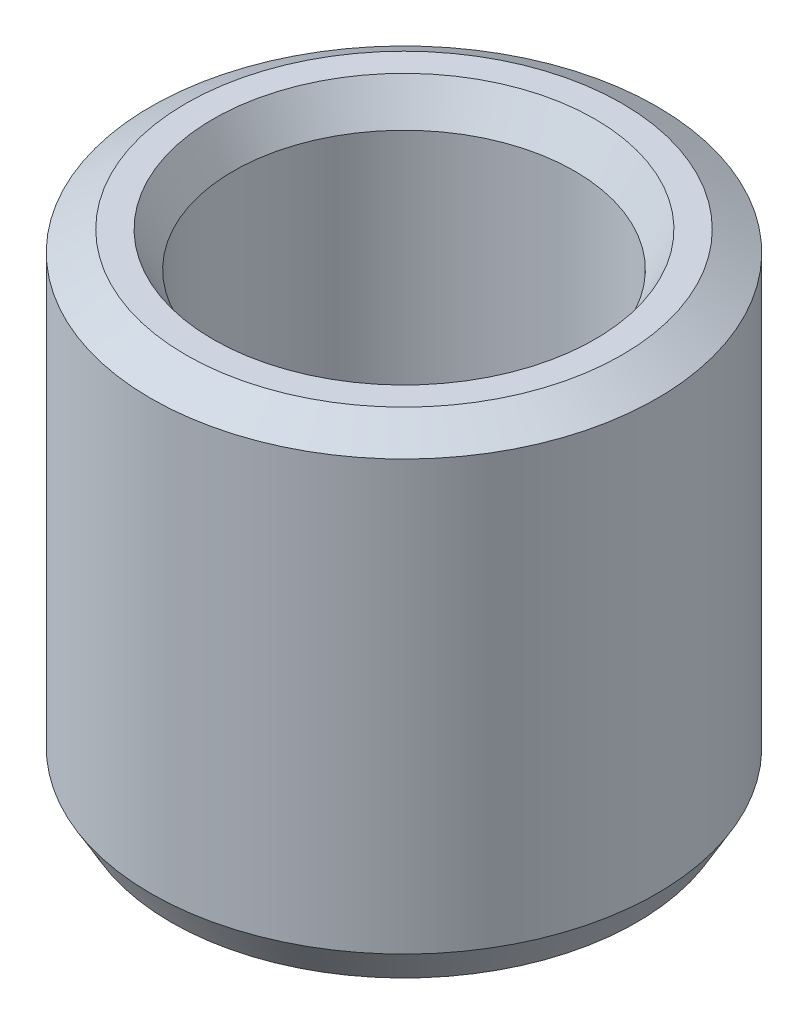
ISO-10303-21;
HEADER;
FILE_DESCRIPTION(('STEP AP214'),'2;1');
FILE_NAME('part.step','',(''),(''),'','','');
FILE_SCHEMA(('AUTOMOTIVE_DESIGN { 1 0 10303 214 1 1 1 1 }'));
ENDSEC;
DATA;
#1=APPLICATION_CONTEXT('core data for automotive mechanical design processes');
#2=APPLICATION_PROTOCOL_DEFINITION('international standard','automotive_design',2000,#1);
#3=PRODUCT_CONTEXT('',#1,'mechanical');
#4=PRODUCT('Part','Part','',(#3));
#5=PRODUCT_RELATED_PRODUCT_CATEGORY('part','',(#4));
#6=PRODUCT_DEFINITION_FORMATION('','',#4);
#7=PRODUCT_DEFINITION_CONTEXT('part definition',#1,'design');
#8=PRODUCT_DEFINITION('design','',#6,#7);
#9=PRODUCT_DEFINITION_SHAPE('','',#8);
#10=(LENGTH_UNIT() NAMED_UNIT(*) SI_UNIT(.MILLI.,.METRE.));
#11=(NAMED_UNIT(*) PLANE_ANGLE_UNIT() SI_UNIT($,.RADIAN.));
#12=(NAMED_UNIT(*) SI_UNIT($,.STERADIAN.) SOLID_ANGLE_UNIT());
#13=UNCERTAINTY_MEASURE_WITH_UNIT(LENGTH_MEASURE(1.E-05),#10,'distance_accuracy_value','');
#14=(GEOMETRIC_REPRESENTATION_CONTEXT(3) GLOBAL_UNCERTAINTY_ASSIGNED_CONTEXT((#13)) GLOBAL_UNIT_ASSIGNED_CONTEXT((#10,
#11,#12)) REPRESENTATION_CONTEXT('',''));
#15=CARTESIAN_POINT('',(0.,0.,0.));
#16=DIRECTION('',(0.,0.,1.));
#17=DIRECTION('',(1.,0.,0.));
#18=AXIS2_PLACEMENT_3D('',#15,#16,#17);
#19=CARTESIAN_POINT('',(0.,62.1742375260497,0.));
#20=DIRECTION('',(0.,-1.,0.));
#21=DIRECTION('',(0.,0.,-1.));
#22=AXIS2_PLACEMENT_3D('',#19,#20,#21);
#23=CYLINDRICAL_SURFACE('',#22,32.5);
#24=CARTESIAN_POINT('',(0.,4.49502066950851,0.));
#25=DIRECTION('',(0.,1.,0.));
#26=DIRECTION('',(0.,0.,1.));
#27=AXIS2_PLACEMENT_3D('',#24,#25,#26);
#28=CIRCLE('',#27,32.5);
#29=CARTESIAN_POINT('',(0.,4.49502066950851,-32.5));
#30=VERTEX_POINT('',#29);
#31=EDGE_CURVE('E10',#30,#30,#28,.T.);
#32=CARTESIAN_POINT('',(0.,59.5790361324961,0.));
#33=DIRECTION('',(0.,1.,0.));
#34=DIRECTION('',(0.,0.,1.));
#35=AXIS2_PLACEMENT_3D('',#32,#33,#34);
#36=CIRCLE('',#35,32.5);
#37=CARTESIAN_POINT('',(0.,59.5790361324961,-32.5));
#38=VERTEX_POINT('',#37);
#39=EDGE_CURVE('E50',#38,#38,#36,.F.);
#40=CARTESIAN_POINT('',(0.,4.49502066950851,-32.5));
#41=CARTESIAN_POINT('',(0.,5.06881249724796,-32.5));
#42=CARTESIAN_POINT('',(0.,5.64260432498741,-32.5));
#43=CARTESIAN_POINT('',(0.,6.79018798046632,-32.5));
#44=CARTESIAN_POINT('',(0.,7.36397980820578,-32.5));
#45=CARTESIAN_POINT('',(0.,8.51156346368468,-32.5));
#46=CARTESIAN_POINT('',(0.,9.08535529142414,-32.5));
#47=CARTESIAN_POINT('',(0.,10.232938946903,-32.5));
#48=CARTESIAN_POINT('',(0.,10.8067307746425,-32.5));
#49=CARTESIAN_POINT('',(0.,11.9543144301214,-32.5));
#50=CARTESIAN_POINT('',(0.,12.5281062578609,-32.5));
#51=CARTESIAN_POINT('',(0.,13.6756899133398,-32.5));
#52=CARTESIAN_POINT('',(0.,14.2494817410792,-32.5));
#53=CARTESIAN_POINT('',(0.,15.3970653965581,-32.5));
#54=CARTESIAN_POINT('',(0.,15.9708572242976,-32.5));
#55=CARTESIAN_POINT('',(0.,17.1184408797765,-32.5));
#56=CARTESIAN_POINT('',(0.,17.6922327075159,-32.5));
#57=CARTESIAN_POINT('',(0.,18.8398163629948,-32.5));
#58=CARTESIAN_POINT('',(0.,19.4136081907343,-32.5));
#59=CARTESIAN_POINT('',(0.,20.5611918462132,-32.5));
#60=CARTESIAN_POINT('',(0.,21.1349836739527,-32.5));
#61=CARTESIAN_POINT('',(0.,22.2825673294316,-32.5));
#62=CARTESIAN_POINT('',(0.,22.856359157171,-32.5));
#63=CARTESIAN_POINT('',(0.,24.0039428126499,-32.5));
#64=CARTESIAN_POINT('',(0.,24.5777346403894,-32.5));
#65=CARTESIAN_POINT('',(0.,25.7253182958683,-32.5));
#66=CARTESIAN_POINT('',(0.,26.2991101236077,-32.5));
#67=CARTESIAN_POINT('',(0.,27.4466937790867,-32.5));
#68=CARTESIAN_POINT('',(0.,28.0204856068261,-32.5));
#69=CARTESIAN_POINT('',(0.,29.168069262305,-32.5));
#70=CARTESIAN_POINT('',(0.,29.7418610900445,-32.5));
#71=CARTESIAN_POINT('',(0.,30.8894447455234,-32.5));
#72=CARTESIAN_POINT('',(0.,31.4632365732628,-32.5));
#73=CARTESIAN_POINT('',(0.,32.6108202287417,-32.5));
#74=CARTESIAN_POINT('',(0.,33.1846120564812,-32.5));
#75=CARTESIAN_POINT('',(0.,34.3321957119601,-32.5));
#76=CARTESIAN_POINT('',(0.,34.9059875396995,-32.5));
#77=CARTESIAN_POINT('',(0.,36.0535711951785,-32.5));
#78=CARTESIAN_POINT('',(0.,36.6273630229179,-32.5));
#79=CARTESIAN_POINT('',(0.,37.7749466783968,-32.5));
#80=CARTESIAN_POINT('',(0.,38.3487385061363,-32.5));
#81=CARTESIAN_POINT('',(0.,39.4963221616152,-32.5));
#82=CARTESIAN_POINT('',(0.,40.0701139893546,-32.5));
#83=CARTESIAN_POINT('',(0.,41.2176976448335,-32.5));
#84=CARTESIAN_POINT('',(0.,41.791489472573,-32.5));
#85=CARTESIAN_POINT('',(0.,42.9390731280519,-32.5));
#86=CARTESIAN_POINT('',(0.,43.5128649557914,-32.5));
#87=CARTESIAN_POINT('',(0.,44.6604486112703,-32.5));
#88=CARTESIAN_POINT('',(0.,45.2342404390097,-32.5));
#89=CARTESIAN_POINT('',(0.,46.3818240944886,-32.5));
#90=CARTESIAN_POINT('',(0.,46.9556159222281,-32.5));
#91=CARTESIAN_POINT('',(0.,48.103199577707,-32.5));
#92=CARTESIAN_POINT('',(0.,48.6769914054464,-32.5));
#93=CARTESIAN_POINT('',(0.,49.8245750609253,-32.5));
#94=CARTESIAN_POINT('',(0.,50.3983668886648,-32.5));
#95=CARTESIAN_POINT('',(0.,51.5459505441437,-32.5));
#96=CARTESIAN_POINT('',(0.,52.1197423718832,-32.5));
#97=CARTESIAN_POINT('',(0.,53.2673260273621,-32.5));
#98=CARTESIAN_POINT('',(0.,53.8411178551015,-32.5));
#99=CARTESIAN_POINT('',(0.,54.9887015105804,-32.5));
#100=CARTESIAN_POINT('',(0.,55.5624933383199,-32.5));
#101=CARTESIAN_POINT('',(0.,56.7100769937988,-32.5));
#102=CARTESIAN_POINT('',(0.,57.2838688215382,-32.5));
#103=CARTESIAN_POINT('',(0.,58.4314524770171,-32.5));
#104=CARTESIAN_POINT('',(0.,59.0052443047566,-32.5));
#105=CARTESIAN_POINT('',(0.,59.5790361324961,-32.5));
#106=B_SPLINE_CURVE_WITH_KNOTS('',3,(#40,#41,#42,#43,#44,#45,#46,#47,#48,#49,#50,#51,#52,#53,
#54,#55,#56,#57,#58,#59,#60,#61,#62,#63,#64,#65,#66,#67,#68,#69,#70,#71,#72,#73,#74,#75,#76,#77,
#78,#79,#80,#81,#82,#83,#84,#85,#86,#87,#88,#89,#90,#91,#92,#93,#94,#95,#96,#97,#98,#99,#100,
#101,#102,#103,#104,#105),.UNSPECIFIED.,.F.,.F.,(4,2,2,2,2,2,2,2,2,2,2,2,2,2,2,2,2,2,2,2,2,2,2,
2,2,2,2,2,2,2,2,2,4),(0.,1.72137548321836,3.44275096643672,5.16412644965508,6.88550193287345,
8.60687741609181,10.3282528993102,12.0496283825285,13.7710038657469,15.4923793489652,
17.2137548321836,18.935130315402,20.6565057986203,22.3778812818387,24.0992567650571,
25.8206322482754,27.5420077314938,29.2633832147121,30.9847586979305,32.7061341811489,
34.4275096643672,36.1488851475856,37.8702606308039,39.5916361140223,41.3130115972407,
43.034387080459,44.7557625636774,46.4771380468957,48.1985135301141,49.9198890133325,
51.6412644965508,53.3626399797692,55.0840154629875),.UNSPECIFIED.);
#107=EDGE_CURVE('BSEAM39',#30,#38,#106,.T.);
#108=ORIENTED_EDGE('',*,*,#31,.T.);
#109=ORIENTED_EDGE('',*,*,#39,.T.);
#110=ORIENTED_EDGE('',*,*,#107,.T.);
#111=ORIENTED_EDGE('',*,*,#107,.F.);
#112=EDGE_LOOP('',(#108,#110,#109,#111));
#113=FACE_BOUND('',#112,.T.);
#114=ADVANCED_FACE('F39',(#113),#23,.T.);
#115=CARTESIAN_POINT('',(0.,62.1742375260497,0.));
#116=DIRECTION('',(0.,1.,0.));
#117=DIRECTION('',(0.,0.,1.));
#118=AXIS2_PLACEMENT_3D('',#115,#116,#117);
#119=PLANE('',#118);
#120=CARTESIAN_POINT('',(0.,62.1742375260497,0.));
#121=DIRECTION('',(0.,1.,0.));
#122=DIRECTION('',(0.,0.,1.));
#123=AXIS2_PLACEMENT_3D('',#120,#121,#122);
#124=CIRCLE('',#123,24.5246577143299);
#125=CARTESIAN_POINT('',(0.,62.1742375260497,24.5246577143299));
#126=VERTEX_POINT('',#125);
#127=EDGE_CURVE('E58',#126,#126,#124,.F.);
#128=ORIENTED_EDGE('',*,*,#127,.T.);
#129=EDGE_LOOP('',(#128));
#130=FACE_BOUND('',#129,.T.);
#131=CARTESIAN_POINT('',(0.,62.1742375260497,0.));
#132=DIRECTION('',(0.,1.,0.));
#133=DIRECTION('',(0.,0.,1.));
#134=AXIS2_PLACEMENT_3D('',#131,#132,#133);
#135=CIRCLE('',#134,28.0049793304917);
#136=CARTESIAN_POINT('',(0.,62.1742375260497,28.0049793304917));
#137=VERTEX_POINT('',#136);
#138=EDGE_CURVE('E61',#137,#137,#135,.T.);
#139=ORIENTED_EDGE('',*,*,#138,.T.);
#140=EDGE_LOOP('',(#139));
#141=FACE_BOUND('',#140,.T.);
#142=ADVANCED_FACE('F88',(#130,#141),#119,.T.);
#143=CARTESIAN_POINT('',(0.,0.,0.));
#144=DIRECTION('',(0.,1.,0.));
#145=DIRECTION('',(0.,0.,1.));
#146=AXIS2_PLACEMENT_3D('',#143,#144,#145);
#147=PLANE('',#146);
#148=CARTESIAN_POINT('',(0.,0.,0.));
#149=DIRECTION('',(0.,1.,0.));
#150=DIRECTION('',(0.,0.,1.));
#151=AXIS2_PLACEMENT_3D('',#148,#149,#150);
#152=CIRCLE('',#151,26.4244769902846);
#153=CARTESIAN_POINT('',(0.,0.,26.4244769902846));
#154=VERTEX_POINT('',#153);
#155=EDGE_CURVE('E51',#154,#154,#152,.T.);
#156=ORIENTED_EDGE('',*,*,#155,.T.);
#157=EDGE_LOOP('',(#156));
#158=FACE_BOUND('',#157,.T.);
#159=CARTESIAN_POINT('',(0.,0.,0.));
#160=DIRECTION('',(0.,1.,0.));
#161=DIRECTION('',(0.,0.,1.));
#162=AXIS2_PLACEMENT_3D('',#159,#160,#161);
#163=CIRCLE('',#162,29.9047986064463);
#164=CARTESIAN_POINT('',(0.,0.,29.9047986064463));
#165=VERTEX_POINT('',#164);
#166=EDGE_CURVE('E54',#165,#165,#163,.F.);
#167=ORIENTED_EDGE('',*,*,#166,.T.);
#168=EDGE_LOOP('',(#167));
#169=FACE_BOUND('',#168,.T.);
#170=ADVANCED_FACE('F83',(#158,#169),#147,.F.);
#171=CARTESIAN_POINT('',(0.,62.1742375260497,0.));
#172=DIRECTION('',(0.,-1.,0.));
#173=DIRECTION('',(0.,0.,-1.));
#174=AXIS2_PLACEMENT_3D('',#171,#172,#173);
#175=CYLINDRICAL_SURFACE('',#174,21.9294563207762);
#176=CARTESIAN_POINT('',(0.,57.6792168565412,0.));
#177=DIRECTION('',(0.,1.,0.));
#178=DIRECTION('',(0.,0.,1.));
#179=AXIS2_PLACEMENT_3D('',#176,#177,#178);
#180=CIRCLE('',#179,21.9294563207762);
#181=CARTESIAN_POINT('',(0.,57.6792168565412,-21.9294563207762));
#182=VERTEX_POINT('',#181);
#183=EDGE_CURVE('E67',#182,#182,#180,.T.);
#184=CARTESIAN_POINT('',(0.,2.59520139355359,0.));
#185=DIRECTION('',(0.,1.,0.));
#186=DIRECTION('',(0.,0.,1.));
#187=AXIS2_PLACEMENT_3D('',#184,#185,#186);
#188=CIRCLE('',#187,21.9294563207762);
#189=CARTESIAN_POINT('',(0.,2.59520139355358,-21.9294563207762));
#190=VERTEX_POINT('',#189);
#191=EDGE_CURVE('E69',#190,#190,#188,.F.);
#192=CARTESIAN_POINT('',(0.,57.6792168565412,-21.9294563207762));
#193=CARTESIAN_POINT('',(0.,57.1054250288018,-21.9294563207762));
#194=CARTESIAN_POINT('',(0.,56.5316332010623,-21.9294563207762));
#195=CARTESIAN_POINT('',(0.,55.3840495455834,-21.9294563207762));
#196=CARTESIAN_POINT('',(0.,54.8102577178439,-21.9294563207762));
#197=CARTESIAN_POINT('',(0.,53.662674062365,-21.9294563207762));
#198=CARTESIAN_POINT('',(0.,53.0888822346256,-21.9294563207762));
#199=CARTESIAN_POINT('',(0.,51.9412985791467,-21.9294563207762));
#200=CARTESIAN_POINT('',(0.,51.3675067514072,-21.9294563207762));
#201=CARTESIAN_POINT('',(0.,50.2199230959283,-21.9294563207762));
#202=CARTESIAN_POINT('',(0.,49.6461312681888,-21.9294563207762));
#203=CARTESIAN_POINT('',(0.,48.4985476127099,-21.9294563207762));
#204=CARTESIAN_POINT('',(0.,47.9247557849705,-21.9294563207762));
#205=CARTESIAN_POINT('',(0.,46.7771721294916,-21.9294563207762));
#206=CARTESIAN_POINT('',(0.,46.2033803017521,-21.9294563207762));
#207=CARTESIAN_POINT('',(0.,45.0557966462732,-21.9294563207762));
#208=CARTESIAN_POINT('',(0.,44.4820048185338,-21.9294563207762));
#209=CARTESIAN_POINT('',(0.,43.3344211630549,-21.9294563207762));
#210=CARTESIAN_POINT('',(0.,42.7606293353154,-21.9294563207762));
#211=CARTESIAN_POINT('',(0.,41.6130456798365,-21.9294563207762));
#212=CARTESIAN_POINT('',(0.,41.039253852097,-21.9294563207762));
#213=CARTESIAN_POINT('',(0.,39.8916701966181,-21.9294563207762));
#214=CARTESIAN_POINT('',(0.,39.3178783688787,-21.9294563207762));
#215=CARTESIAN_POINT('',(0.,38.1702947133998,-21.9294563207762));
#216=CARTESIAN_POINT('',(0.,37.5965028856603,-21.9294563207762));
#217=CARTESIAN_POINT('',(0.,36.4489192301814,-21.9294563207762));
#218=CARTESIAN_POINT('',(0.,35.8751274024419,-21.9294563207762));
#219=CARTESIAN_POINT('',(0.,34.727543746963,-21.9294563207762));
#220=CARTESIAN_POINT('',(0.,34.1537519192236,-21.9294563207762));
#221=CARTESIAN_POINT('',(0.,33.0061682637447,-21.9294563207762));
#222=CARTESIAN_POINT('',(0.,32.4323764360052,-21.9294563207762));
#223=CARTESIAN_POINT('',(0.,31.2847927805263,-21.9294563207762));
#224=CARTESIAN_POINT('',(0.,30.7110009527869,-21.9294563207762));
#225=CARTESIAN_POINT('',(0.,29.5634172973079,-21.9294563207762));
#226=CARTESIAN_POINT('',(0.,28.9896254695685,-21.9294563207762));
#227=CARTESIAN_POINT('',(0.,27.8420418140896,-21.9294563207762));
#228=CARTESIAN_POINT('',(0.,27.2682499863501,-21.9294563207762));
#229=CARTESIAN_POINT('',(0.,26.1206663308712,-21.9294563207762));
#230=CARTESIAN_POINT('',(0.,25.5468745031318,-21.9294563207762));
#231=CARTESIAN_POINT('',(0.,24.3992908476528,-21.9294563207762));
#232=CARTESIAN_POINT('',(0.,23.8254990199134,-21.9294563207762));
#233=CARTESIAN_POINT('',(0.,22.6779153644345,-21.9294563207762));
#234=CARTESIAN_POINT('',(0.,22.104123536695,-21.9294563207762));
#235=CARTESIAN_POINT('',(0.,20.9565398812161,-21.9294563207762));
#236=CARTESIAN_POINT('',(0.,20.3827480534767,-21.9294563207762));
#237=CARTESIAN_POINT('',(0.,19.2351643979978,-21.9294563207762));
#238=CARTESIAN_POINT('',(0.,18.6613725702583,-21.9294563207762));
#239=CARTESIAN_POINT('',(0.,17.5137889147794,-21.9294563207762));
#240=CARTESIAN_POINT('',(0.,16.9399970870399,-21.9294563207762));
#241=CARTESIAN_POINT('',(0.,15.792413431561,-21.9294563207762));
#242=CARTESIAN_POINT('',(0.,15.2186216038216,-21.9294563207762));
#243=CARTESIAN_POINT('',(0.,14.0710379483427,-21.9294563207762));
#244=CARTESIAN_POINT('',(0.,13.4972461206032,-21.9294563207762));
#245=CARTESIAN_POINT('',(0.,12.3496624651243,-21.9294563207762));
#246=CARTESIAN_POINT('',(0.,11.7758706373849,-21.9294563207762));
#247=CARTESIAN_POINT('',(0.,10.6282869819059,-21.9294563207762));
#248=CARTESIAN_POINT('',(0.,10.0544951541665,-21.9294563207762));
#249=CARTESIAN_POINT('',(0.,8.90691149868758,-21.9294563207762));
#250=CARTESIAN_POINT('',(0.,8.33311967094812,-21.9294563207762));
#251=CARTESIAN_POINT('',(0.,7.18553601546922,-21.9294563207762));
#252=CARTESIAN_POINT('',(0.,6.61174418772976,-21.9294563207762));
#253=CARTESIAN_POINT('',(0.,5.46416053225086,-21.9294563207762));
#254=CARTESIAN_POINT('',(0.,4.8903687045114,-21.9294563207762));
#255=CARTESIAN_POINT('',(0.,3.74278504903249,-21.9294563207762));
#256=CARTESIAN_POINT('',(0.,3.16899322129304,-21.9294563207762));
#257=CARTESIAN_POINT('',(0.,2.59520139355358,-21.9294563207762));
#258=B_SPLINE_CURVE_WITH_KNOTS('',3,(#192,#193,#194,#195,#196,#197,#198,#199,#200,#201,#202,
#203,#204,#205,#206,#207,#208,#209,#210,#211,#212,#213,#214,#215,#216,#217,#218,#219,#220,#221,
#222,#223,#224,#225,#226,#227,#228,#229,#230,#231,#232,#233,#234,#235,#236,#237,#238,#239,#240,
#241,#242,#243,#244,#245,#246,#247,#248,#249,#250,#251,#252,#253,#254,#255,#256,#257),
.UNSPECIFIED.,.F.,.F.,(4,2,2,2,2,2,2,2,2,2,2,2,2,2,2,2,2,2,2,2,2,2,2,2,2,2,2,2,2,2,2,2,4),(0.,
1.72137548321837,3.44275096643673,5.16412644965509,6.88550193287345,8.60687741609182,
10.3282528993102,12.0496283825285,13.7710038657469,15.4923793489653,17.2137548321836,
18.935130315402,20.6565057986204,22.3778812818387,24.0992567650571,25.8206322482755,
27.5420077314938,29.2633832147122,30.9847586979305,32.7061341811489,34.4275096643673,
36.1488851475856,37.870260630804,39.5916361140224,41.3130115972407,43.0343870804591,
44.7557625636775,46.4771380468958,48.1985135301142,49.9198890133325,51.6412644965509,
53.3626399797693,55.0840154629876),.UNSPECIFIED.);
#259=EDGE_CURVE('BSEAM71',#182,#190,#258,.T.);
#260=ORIENTED_EDGE('',*,*,#183,.T.);
#261=ORIENTED_EDGE('',*,*,#191,.T.);
#262=ORIENTED_EDGE('',*,*,#259,.T.);
#263=ORIENTED_EDGE('',*,*,#259,.F.);
#264=EDGE_LOOP('',(#260,#262,#261,#263));
#265=FACE_BOUND('',#264,.T.);
#266=ADVANCED_FACE('F71',(#265),#175,.F.);
#267=CARTESIAN_POINT('',(0.,57.6792168565412,0.));
#268=DIRECTION('',(0.,1.,0.));
#269=DIRECTION('',(0.,0.,1.));
#270=AXIS2_PLACEMENT_3D('',#267,#268,#269);
#271=CONICAL_SURFACE('',#270,21.9294563207762,0.523598775598303);
#272=ORIENTED_EDGE('',*,*,#127,.F.);
#273=EDGE_LOOP('',(#272));
#274=FACE_BOUND('',#273,.T.);
#275=ORIENTED_EDGE('',*,*,#183,.F.);
#276=EDGE_LOOP('',(#275));
#277=FACE_BOUND('',#276,.T.);
#278=ADVANCED_FACE('F77',(#274,#277),#271,.F.);
#279=CARTESIAN_POINT('',(0.,0.,0.));
#280=DIRECTION('',(0.,-1.,0.));
#281=DIRECTION('',(0.,0.,-1.));
#282=AXIS2_PLACEMENT_3D('',#279,#280,#281);
#283=CONICAL_SURFACE('',#282,26.4244769902846,1.04719755119659);
#284=ORIENTED_EDGE('',*,*,#191,.F.);
#285=EDGE_LOOP('',(#284));
#286=FACE_BOUND('',#285,.T.);
#287=ORIENTED_EDGE('',*,*,#155,.F.);
#288=EDGE_LOOP('',(#287));
#289=FACE_BOUND('',#288,.T.);
#290=ADVANCED_FACE('F73',(#286,#289),#283,.F.);
#291=CARTESIAN_POINT('',(0.,4.49502066950851,0.));
#292=DIRECTION('',(0.,1.,0.));
#293=DIRECTION('',(0.,0.,1.));
#294=AXIS2_PLACEMENT_3D('',#291,#292,#293);
#295=CONICAL_SURFACE('',#294,32.5,0.523598775598301);
#296=ORIENTED_EDGE('',*,*,#166,.F.);
#297=EDGE_LOOP('',(#296));
#298=FACE_BOUND('',#297,.T.);
#299=ORIENTED_EDGE('',*,*,#31,.F.);
#300=EDGE_LOOP('',(#299));
#301=FACE_BOUND('',#300,.T.);
#302=ADVANCED_FACE('F76',(#298,#301),#295,.T.);
#303=CARTESIAN_POINT('',(0.,62.1742375260497,0.));
#304=DIRECTION('',(0.,-1.,0.));
#305=DIRECTION('',(0.,0.,-1.));
#306=AXIS2_PLACEMENT_3D('',#303,#304,#305);
#307=CONICAL_SURFACE('',#306,28.0049793304917,1.04719755119659);
#308=ORIENTED_EDGE('',*,*,#39,.F.);
#309=EDGE_LOOP('',(#308));
#310=FACE_BOUND('',#309,.T.);
#311=ORIENTED_EDGE('',*,*,#138,.F.);
#312=EDGE_LOOP('',(#311));
#313=FACE_BOUND('',#312,.T.);
#314=ADVANCED_FACE('F45',(#310,#313),#307,.T.);
#315=CLOSED_SHELL('',(#114,#142,#170,#266,#278,#290,#302,#314));
#316=MANIFOLD_SOLID_BREP('B2',#315);
#317=ADVANCED_BREP_SHAPE_REPRESENTATION('',(#18,#316),#14);
#318=SHAPE_DEFINITION_REPRESENTATION(#9,#317);
ENDSEC;
END-ISO-10303-21;
